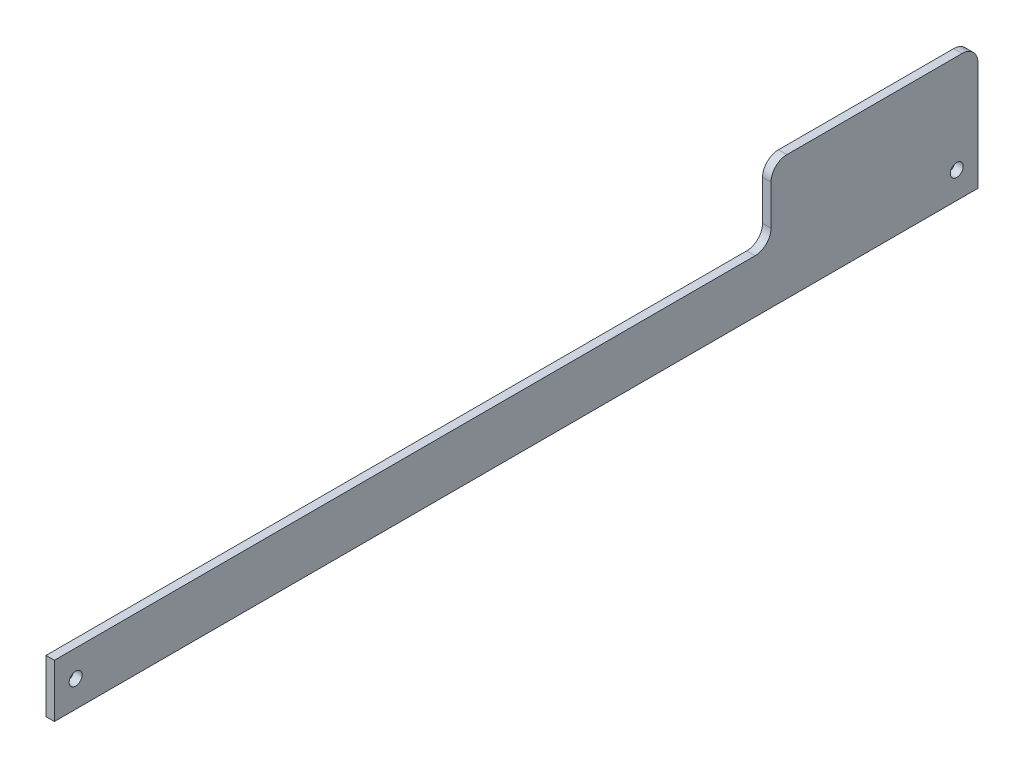
ISO-10303-21;
HEADER;
FILE_DESCRIPTION(('STEP AP214'),'2;1');
FILE_NAME('part.step','',(''),(''),'','','');
FILE_SCHEMA(('AUTOMOTIVE_DESIGN { 1 0 10303 214 1 1 1 1 }'));
ENDSEC;
DATA;
#1=APPLICATION_CONTEXT('core data for automotive mechanical design processes');
#2=APPLICATION_PROTOCOL_DEFINITION('international standard','automotive_design',2000,#1);
#3=PRODUCT_CONTEXT('',#1,'mechanical');
#4=PRODUCT('Part','Part','',(#3));
#5=PRODUCT_RELATED_PRODUCT_CATEGORY('part','',(#4));
#6=PRODUCT_DEFINITION_FORMATION('','',#4);
#7=PRODUCT_DEFINITION_CONTEXT('part definition',#1,'design');
#8=PRODUCT_DEFINITION('design','',#6,#7);
#9=PRODUCT_DEFINITION_SHAPE('','',#8);
#10=(LENGTH_UNIT() NAMED_UNIT(*) SI_UNIT(.MILLI.,.METRE.));
#11=(NAMED_UNIT(*) PLANE_ANGLE_UNIT() SI_UNIT($,.RADIAN.));
#12=(NAMED_UNIT(*) SI_UNIT($,.STERADIAN.) SOLID_ANGLE_UNIT());
#13=UNCERTAINTY_MEASURE_WITH_UNIT(LENGTH_MEASURE(1.E-05),#10,'distance_accuracy_value','');
#14=(GEOMETRIC_REPRESENTATION_CONTEXT(3) GLOBAL_UNCERTAINTY_ASSIGNED_CONTEXT((#13)) GLOBAL_UNIT_ASSIGNED_CONTEXT((#10,
#11,#12)) REPRESENTATION_CONTEXT('',''));
#15=CARTESIAN_POINT('',(0.,0.,0.));
#16=DIRECTION('',(0.,0.,1.));
#17=DIRECTION('',(1.,0.,0.));
#18=AXIS2_PLACEMENT_3D('',#15,#16,#17);
#19=CARTESIAN_POINT('',(1.5875,10.,0.));
#20=DIRECTION('',(0.,0.,-1.));
#21=DIRECTION('',(0.,1.,0.));
#22=AXIS2_PLACEMENT_3D('',#19,#20,#21);
#23=PLANE('',#22);
#24=DIRECTION('',(0.,-1.,0.));
#25=VECTOR('',#24,1.);
#26=CARTESIAN_POINT('',(0.,10.,0.));
#27=LINE('',#26,#25);
#28=CARTESIAN_POINT('',(0.,10.,0.));
#29=VERTEX_POINT('',#28);
#30=CARTESIAN_POINT('',(0.,0.,0.));
#31=VERTEX_POINT('',#30);
#32=EDGE_CURVE('E128',#29,#31,#27,.T.);
#33=ORIENTED_EDGE('',*,*,#32,.T.);
#34=DIRECTION('',(-1.,0.,0.));
#35=VECTOR('',#34,1.);
#36=CARTESIAN_POINT('',(1.5875,0.,0.));
#37=LINE('',#36,#35);
#38=CARTESIAN_POINT('',(1.5875,0.,0.));
#39=VERTEX_POINT('',#38);
#40=EDGE_CURVE('E110',#39,#31,#37,.T.);
#41=ORIENTED_EDGE('',*,*,#40,.F.);
#42=DIRECTION('',(0.,-1.,0.));
#43=VECTOR('',#42,1.);
#44=CARTESIAN_POINT('',(1.5875,10.,0.));
#45=LINE('',#44,#43);
#46=CARTESIAN_POINT('',(1.5875,10.,0.));
#47=VERTEX_POINT('',#46);
#48=EDGE_CURVE('E116',#47,#39,#45,.T.);
#49=ORIENTED_EDGE('',*,*,#48,.F.);
#50=DIRECTION('',(-1.,0.,0.));
#51=VECTOR('',#50,1.);
#52=CARTESIAN_POINT('',(1.5875,10.,0.));
#53=LINE('',#52,#51);
#54=EDGE_CURVE('E134',#47,#29,#53,.T.);
#55=ORIENTED_EDGE('',*,*,#54,.T.);
#56=EDGE_LOOP('',(#33,#41,#49,#55));
#57=FACE_BOUND('',#56,.T.);
#58=ADVANCED_FACE('F32',(#57),#23,.F.);
#59=CARTESIAN_POINT('',(1.5875,0.,0.));
#60=DIRECTION('',(0.,1.,0.));
#61=DIRECTION('',(0.,0.,1.));
#62=AXIS2_PLACEMENT_3D('',#59,#60,#61);
#63=PLANE('',#62);
#64=DIRECTION('',(0.,0.,-1.));
#65=VECTOR('',#64,1.);
#66=CARTESIAN_POINT('',(0.,0.,0.));
#67=LINE('',#66,#65);
#68=CARTESIAN_POINT('',(0.,0.,-174.));
#69=VERTEX_POINT('',#68);
#70=EDGE_CURVE('E181',#31,#69,#67,.T.);
#71=ORIENTED_EDGE('',*,*,#70,.T.);
#72=DIRECTION('',(-1.,0.,0.));
#73=VECTOR('',#72,1.);
#74=CARTESIAN_POINT('',(1.5875,0.,-174.));
#75=LINE('',#74,#73);
#76=CARTESIAN_POINT('',(1.5875,0.,-174.));
#77=VERTEX_POINT('',#76);
#78=EDGE_CURVE('E113',#77,#69,#75,.T.);
#79=ORIENTED_EDGE('',*,*,#78,.F.);
#80=DIRECTION('',(0.,0.,-1.));
#81=VECTOR('',#80,1.);
#82=CARTESIAN_POINT('',(1.5875,0.,0.));
#83=LINE('',#82,#81);
#84=EDGE_CURVE('E106',#39,#77,#83,.T.);
#85=ORIENTED_EDGE('',*,*,#84,.F.);
#86=ORIENTED_EDGE('',*,*,#40,.T.);
#87=EDGE_LOOP('',(#71,#79,#85,#86));
#88=FACE_BOUND('',#87,.T.);
#89=ADVANCED_FACE('F108',(#88),#63,.F.);
#90=CARTESIAN_POINT('',(1.5875,0.,-174.));
#91=DIRECTION('',(0.,0.,1.));
#92=DIRECTION('',(1.,0.,0.));
#93=AXIS2_PLACEMENT_3D('',#90,#91,#92);
#94=PLANE('',#93);
#95=DIRECTION('',(0.,1.,0.));
#96=VECTOR('',#95,1.);
#97=CARTESIAN_POINT('',(0.,0.,-174.));
#98=LINE('',#97,#96);
#99=CARTESIAN_POINT('',(0.,20.5,-174.));
#100=VERTEX_POINT('',#99);
#101=EDGE_CURVE('E184',#69,#100,#98,.T.);
#102=ORIENTED_EDGE('',*,*,#101,.T.);
#103=DIRECTION('',(-1.,0.,0.));
#104=VECTOR('',#103,1.);
#105=CARTESIAN_POINT('',(1.5875,20.5,-174.));
#106=LINE('',#105,#104);
#107=CARTESIAN_POINT('',(1.5875,20.5,-174.));
#108=VERTEX_POINT('',#107);
#109=EDGE_CURVE('E47',#100,#108,#106,.F.);
#110=ORIENTED_EDGE('',*,*,#109,.T.);
#111=DIRECTION('',(0.,1.,0.));
#112=VECTOR('',#111,1.);
#113=CARTESIAN_POINT('',(1.5875,0.,-174.));
#114=LINE('',#113,#112);
#115=EDGE_CURVE('E115',#77,#108,#114,.T.);
#116=ORIENTED_EDGE('',*,*,#115,.F.);
#117=ORIENTED_EDGE('',*,*,#78,.T.);
#118=EDGE_LOOP('',(#102,#110,#116,#117));
#119=FACE_BOUND('',#118,.T.);
#120=ADVANCED_FACE('F188',(#119),#94,.F.);
#121=CARTESIAN_POINT('',(1.5875,23.5,-174.));
#122=DIRECTION('',(0.,-1.,0.));
#123=DIRECTION('',(0.,0.,-1.));
#124=AXIS2_PLACEMENT_3D('',#121,#122,#123);
#125=PLANE('',#124);
#126=DIRECTION('',(0.,0.,1.));
#127=VECTOR('',#126,1.);
#128=CARTESIAN_POINT('',(0.,23.5,-174.));
#129=LINE('',#128,#127);
#130=CARTESIAN_POINT('',(0.,23.5,-171.));
#131=VERTEX_POINT('',#130);
#132=CARTESIAN_POINT('',(0.,23.5,-138.));
#133=VERTEX_POINT('',#132);
#134=EDGE_CURVE('E168',#131,#133,#129,.T.);
#135=ORIENTED_EDGE('',*,*,#134,.T.);
#136=DIRECTION('',(-1.,0.,0.));
#137=VECTOR('',#136,1.);
#138=CARTESIAN_POINT('',(1.5875,23.5,-138.));
#139=LINE('',#138,#137);
#140=CARTESIAN_POINT('',(1.5875,23.5,-138.));
#141=VERTEX_POINT('',#140);
#142=EDGE_CURVE('E55',#133,#141,#139,.F.);
#143=ORIENTED_EDGE('',*,*,#142,.T.);
#144=DIRECTION('',(0.,0.,1.));
#145=VECTOR('',#144,1.);
#146=CARTESIAN_POINT('',(1.5875,23.5,-174.));
#147=LINE('',#146,#145);
#148=CARTESIAN_POINT('',(1.5875,23.5,-171.));
#149=VERTEX_POINT('',#148);
#150=EDGE_CURVE('E176',#149,#141,#147,.T.);
#151=ORIENTED_EDGE('',*,*,#150,.F.);
#152=DIRECTION('',(-1.,0.,0.));
#153=VECTOR('',#152,1.);
#154=CARTESIAN_POINT('',(1.5875,23.5,-171.));
#155=LINE('',#154,#153);
#156=EDGE_CURVE('E146',#149,#131,#155,.T.);
#157=ORIENTED_EDGE('',*,*,#156,.T.);
#158=EDGE_LOOP('',(#135,#143,#151,#157));
#159=FACE_BOUND('',#158,.T.);
#160=ADVANCED_FACE('F242',(#159),#125,.F.);
#161=CARTESIAN_POINT('',(1.5875,23.5,-135.));
#162=DIRECTION('',(0.,0.,-1.));
#163=DIRECTION('',(-1.,0.,0.));
#164=AXIS2_PLACEMENT_3D('',#161,#162,#163);
#165=PLANE('',#164);
#166=DIRECTION('',(0.,-1.,0.));
#167=VECTOR('',#166,1.);
#168=CARTESIAN_POINT('',(0.,23.5,-135.));
#169=LINE('',#168,#167);
#170=CARTESIAN_POINT('',(0.,20.5,-135.));
#171=VERTEX_POINT('',#170);
#172=CARTESIAN_POINT('',(0.,13.,-135.));
#173=VERTEX_POINT('',#172);
#174=EDGE_CURVE('E159',#171,#173,#169,.T.);
#175=ORIENTED_EDGE('',*,*,#174,.T.);
#176=DIRECTION('',(-1.,0.,0.));
#177=VECTOR('',#176,1.);
#178=CARTESIAN_POINT('',(1.5875,13.,-135.));
#179=LINE('',#178,#177);
#180=CARTESIAN_POINT('',(1.5875,13.,-135.));
#181=VERTEX_POINT('',#180);
#182=EDGE_CURVE('E140',#173,#181,#179,.F.);
#183=ORIENTED_EDGE('',*,*,#182,.T.);
#184=DIRECTION('',(0.,-1.,0.));
#185=VECTOR('',#184,1.);
#186=CARTESIAN_POINT('',(1.5875,23.5,-135.));
#187=LINE('',#186,#185);
#188=CARTESIAN_POINT('',(1.5875,20.5,-135.));
#189=VERTEX_POINT('',#188);
#190=EDGE_CURVE('E172',#189,#181,#187,.T.);
#191=ORIENTED_EDGE('',*,*,#190,.F.);
#192=DIRECTION('',(-1.,0.,0.));
#193=VECTOR('',#192,1.);
#194=CARTESIAN_POINT('',(1.5875,20.5,-135.));
#195=LINE('',#194,#193);
#196=EDGE_CURVE('E132',#189,#171,#195,.T.);
#197=ORIENTED_EDGE('',*,*,#196,.T.);
#198=EDGE_LOOP('',(#175,#183,#191,#197));
#199=FACE_BOUND('',#198,.T.);
#200=ADVANCED_FACE('F164',(#199),#165,.F.);
#201=CARTESIAN_POINT('',(1.5875,10.,-135.));
#202=DIRECTION('',(0.,-1.,0.));
#203=DIRECTION('',(0.,0.,-1.));
#204=AXIS2_PLACEMENT_3D('',#201,#202,#203);
#205=PLANE('',#204);
#206=DIRECTION('',(0.,0.,1.));
#207=VECTOR('',#206,1.);
#208=CARTESIAN_POINT('',(1.5875,10.,-135.));
#209=LINE('',#208,#207);
#210=CARTESIAN_POINT('',(1.5875,10.,-132.));
#211=VERTEX_POINT('',#210);
#212=EDGE_CURVE('E121',#211,#47,#209,.T.);
#213=ORIENTED_EDGE('',*,*,#212,.F.);
#214=DIRECTION('',(-1.,0.,0.));
#215=VECTOR('',#214,1.);
#216=CARTESIAN_POINT('',(0.,10.,-132.));
#217=LINE('',#216,#215);
#218=CARTESIAN_POINT('',(0.,10.,-132.));
#219=VERTEX_POINT('',#218);
#220=EDGE_CURVE('E129',#211,#219,#217,.T.);
#221=ORIENTED_EDGE('',*,*,#220,.T.);
#222=DIRECTION('',(0.,0.,1.));
#223=VECTOR('',#222,1.);
#224=CARTESIAN_POINT('',(0.,10.,-135.));
#225=LINE('',#224,#223);
#226=EDGE_CURVE('E125',#219,#29,#225,.T.);
#227=ORIENTED_EDGE('',*,*,#226,.T.);
#228=ORIENTED_EDGE('',*,*,#54,.F.);
#229=EDGE_LOOP('',(#213,#221,#227,#228));
#230=FACE_BOUND('',#229,.T.);
#231=ADVANCED_FACE('F174',(#230),#205,.F.);
#232=CARTESIAN_POINT('',(1.5875,0.,0.));
#233=DIRECTION('',(1.,0.,0.));
#234=DIRECTION('',(0.,0.,-1.));
#235=AXIS2_PLACEMENT_3D('',#232,#233,#234);
#236=PLANE('',#235);
#237=CARTESIAN_POINT('',(1.5875,5.,-4.));
#238=DIRECTION('',(1.,0.,0.));
#239=DIRECTION('',(0.,0.,-1.));
#240=AXIS2_PLACEMENT_3D('',#237,#238,#239);
#241=CIRCLE('',#240,1.21919999999999);
#242=CARTESIAN_POINT('',(1.5875,5.,-5.21919999999999));
#243=VERTEX_POINT('',#242);
#244=EDGE_CURVE('E200',#243,#243,#241,.T.);
#245=ORIENTED_EDGE('',*,*,#244,.F.);
#246=EDGE_LOOP('',(#245));
#247=FACE_BOUND('',#246,.T.);
#248=CARTESIAN_POINT('',(1.5875,5.,-170.));
#249=DIRECTION('',(1.,0.,0.));
#250=DIRECTION('',(0.,0.,-1.));
#251=AXIS2_PLACEMENT_3D('',#248,#249,#250);
#252=CIRCLE('',#251,1.21919999999999);
#253=CARTESIAN_POINT('',(1.5875,5.,-171.2192));
#254=VERTEX_POINT('',#253);
#255=EDGE_CURVE('E194',#254,#254,#252,.T.);
#256=ORIENTED_EDGE('',*,*,#255,.F.);
#257=EDGE_LOOP('',(#256));
#258=FACE_BOUND('',#257,.T.);
#259=ORIENTED_EDGE('',*,*,#150,.T.);
#260=CARTESIAN_POINT('',(1.5875,20.5,-138.));
#261=DIRECTION('',(1.,0.,0.));
#262=DIRECTION('',(0.,0.,-1.));
#263=AXIS2_PLACEMENT_3D('',#260,#261,#262);
#264=CIRCLE('',#263,3.);
#265=EDGE_CURVE('E152',#141,#189,#264,.T.);
#266=ORIENTED_EDGE('',*,*,#265,.T.);
#267=ORIENTED_EDGE('',*,*,#190,.T.);
#268=CARTESIAN_POINT('',(1.5875,13.,-132.));
#269=DIRECTION('',(1.,0.,0.));
#270=DIRECTION('',(0.,0.,-1.));
#271=AXIS2_PLACEMENT_3D('',#268,#269,#270);
#272=CIRCLE('',#271,3.);
#273=EDGE_CURVE('E11',#181,#211,#272,.F.);
#274=ORIENTED_EDGE('',*,*,#273,.T.);
#275=ORIENTED_EDGE('',*,*,#212,.T.);
#276=ORIENTED_EDGE('',*,*,#48,.T.);
#277=ORIENTED_EDGE('',*,*,#84,.T.);
#278=ORIENTED_EDGE('',*,*,#115,.T.);
#279=CARTESIAN_POINT('',(1.5875,20.5,-171.));
#280=DIRECTION('',(1.,0.,0.));
#281=DIRECTION('',(0.,0.,-1.));
#282=AXIS2_PLACEMENT_3D('',#279,#280,#281);
#283=CIRCLE('',#282,3.);
#284=EDGE_CURVE('E150',#108,#149,#283,.T.);
#285=ORIENTED_EDGE('',*,*,#284,.T.);
#286=EDGE_LOOP('',(#259,#266,#267,#274,#275,#276,#277,#278,#285));
#287=FACE_BOUND('',#286,.T.);
#288=ADVANCED_FACE('F119',(#247,#258,#287),#236,.T.);
#289=CARTESIAN_POINT('',(0.,0.,0.));
#290=DIRECTION('',(1.,0.,0.));
#291=DIRECTION('',(0.,0.,-1.));
#292=AXIS2_PLACEMENT_3D('',#289,#290,#291);
#293=PLANE('',#292);
#294=CARTESIAN_POINT('',(0.,5.,-4.));
#295=DIRECTION('',(1.,0.,0.));
#296=DIRECTION('',(0.,0.,-1.));
#297=AXIS2_PLACEMENT_3D('',#294,#295,#296);
#298=CIRCLE('',#297,1.2192);
#299=CARTESIAN_POINT('',(0.,5.,-5.2192));
#300=VERTEX_POINT('',#299);
#301=EDGE_CURVE('E197',#300,#300,#298,.T.);
#302=ORIENTED_EDGE('',*,*,#301,.T.);
#303=EDGE_LOOP('',(#302));
#304=FACE_BOUND('',#303,.T.);
#305=CARTESIAN_POINT('',(0.,5.,-170.));
#306=DIRECTION('',(1.,0.,0.));
#307=DIRECTION('',(0.,0.,-1.));
#308=AXIS2_PLACEMENT_3D('',#305,#306,#307);
#309=CIRCLE('',#308,1.2192);
#310=CARTESIAN_POINT('',(0.,5.,-171.2192));
#311=VERTEX_POINT('',#310);
#312=EDGE_CURVE('E182',#311,#311,#309,.T.);
#313=ORIENTED_EDGE('',*,*,#312,.T.);
#314=EDGE_LOOP('',(#313));
#315=FACE_BOUND('',#314,.T.);
#316=ORIENTED_EDGE('',*,*,#174,.F.);
#317=CARTESIAN_POINT('',(0.,20.5,-138.));
#318=DIRECTION('',(1.,0.,0.));
#319=DIRECTION('',(0.,0.,-1.));
#320=AXIS2_PLACEMENT_3D('',#317,#318,#319);
#321=CIRCLE('',#320,3.);
#322=EDGE_CURVE('E144',#171,#133,#321,.F.);
#323=ORIENTED_EDGE('',*,*,#322,.T.);
#324=ORIENTED_EDGE('',*,*,#134,.F.);
#325=CARTESIAN_POINT('',(0.,20.5,-171.));
#326=DIRECTION('',(1.,0.,0.));
#327=DIRECTION('',(0.,0.,-1.));
#328=AXIS2_PLACEMENT_3D('',#325,#326,#327);
#329=CIRCLE('',#328,3.);
#330=EDGE_CURVE('E142',#131,#100,#329,.F.);
#331=ORIENTED_EDGE('',*,*,#330,.T.);
#332=ORIENTED_EDGE('',*,*,#101,.F.);
#333=ORIENTED_EDGE('',*,*,#70,.F.);
#334=ORIENTED_EDGE('',*,*,#32,.F.);
#335=ORIENTED_EDGE('',*,*,#226,.F.);
#336=CARTESIAN_POINT('',(0.,13.,-132.));
#337=DIRECTION('',(1.,0.,0.));
#338=DIRECTION('',(0.,0.,-1.));
#339=AXIS2_PLACEMENT_3D('',#336,#337,#338);
#340=CIRCLE('',#339,3.);
#341=EDGE_CURVE('E40',#219,#173,#340,.T.);
#342=ORIENTED_EDGE('',*,*,#341,.T.);
#343=EDGE_LOOP('',(#316,#323,#324,#331,#332,#333,#334,#335,#342));
#344=FACE_BOUND('',#343,.T.);
#345=ADVANCED_FACE('F158',(#304,#315,#344),#293,.F.);
#346=CARTESIAN_POINT('',(1.5875,5.,-170.));
#347=DIRECTION('',(1.,0.,0.));
#348=DIRECTION('',(0.,0.,-1.));
#349=AXIS2_PLACEMENT_3D('',#346,#347,#348);
#350=CYLINDRICAL_SURFACE('',#349,1.21919999999999);
#351=ORIENTED_EDGE('',*,*,#312,.F.);
#352=EDGE_LOOP('',(#351));
#353=FACE_BOUND('',#352,.T.);
#354=ORIENTED_EDGE('',*,*,#255,.T.);
#355=EDGE_LOOP('',(#354));
#356=FACE_BOUND('',#355,.T.);
#357=ADVANCED_FACE('F211',(#353,#356),#350,.F.);
#358=CARTESIAN_POINT('',(1.5875,5.,-4.));
#359=DIRECTION('',(1.,0.,0.));
#360=DIRECTION('',(0.,0.,-1.));
#361=AXIS2_PLACEMENT_3D('',#358,#359,#360);
#362=CYLINDRICAL_SURFACE('',#361,1.21919999999999);
#363=ORIENTED_EDGE('',*,*,#301,.F.);
#364=EDGE_LOOP('',(#363));
#365=FACE_BOUND('',#364,.T.);
#366=ORIENTED_EDGE('',*,*,#244,.T.);
#367=EDGE_LOOP('',(#366));
#368=FACE_BOUND('',#367,.T.);
#369=ADVANCED_FACE('F204',(#365,#368),#362,.F.);
#370=CARTESIAN_POINT('',(1.5875,13.,-132.));
#371=DIRECTION('',(1.,0.,0.));
#372=DIRECTION('',(0.,0.,-1.));
#373=AXIS2_PLACEMENT_3D('',#370,#371,#372);
#374=CYLINDRICAL_SURFACE('',#373,3.);
#375=ORIENTED_EDGE('',*,*,#273,.F.);
#376=ORIENTED_EDGE('',*,*,#182,.F.);
#377=ORIENTED_EDGE('',*,*,#341,.F.);
#378=ORIENTED_EDGE('',*,*,#220,.F.);
#379=EDGE_LOOP('',(#375,#376,#377,#378));
#380=FACE_BOUND('',#379,.T.);
#381=ADVANCED_FACE('F171',(#380),#374,.F.);
#382=CARTESIAN_POINT('',(1.5875,20.5,-138.));
#383=DIRECTION('',(-1.,0.,0.));
#384=DIRECTION('',(0.,0.,1.));
#385=AXIS2_PLACEMENT_3D('',#382,#383,#384);
#386=CYLINDRICAL_SURFACE('',#385,3.);
#387=ORIENTED_EDGE('',*,*,#265,.F.);
#388=ORIENTED_EDGE('',*,*,#142,.F.);
#389=ORIENTED_EDGE('',*,*,#322,.F.);
#390=ORIENTED_EDGE('',*,*,#196,.F.);
#391=EDGE_LOOP('',(#387,#388,#389,#390));
#392=FACE_BOUND('',#391,.T.);
#393=ADVANCED_FACE('F233',(#392),#386,.T.);
#394=CARTESIAN_POINT('',(1.5875,20.5,-171.));
#395=DIRECTION('',(-1.,0.,0.));
#396=DIRECTION('',(0.,0.,1.));
#397=AXIS2_PLACEMENT_3D('',#394,#395,#396);
#398=CYLINDRICAL_SURFACE('',#397,3.);
#399=ORIENTED_EDGE('',*,*,#284,.F.);
#400=ORIENTED_EDGE('',*,*,#109,.F.);
#401=ORIENTED_EDGE('',*,*,#330,.F.);
#402=ORIENTED_EDGE('',*,*,#156,.F.);
#403=EDGE_LOOP('',(#399,#400,#401,#402));
#404=FACE_BOUND('',#403,.T.);
#405=ADVANCED_FACE('F34',(#404),#398,.T.);
#406=CLOSED_SHELL('',(#58,#89,#120,#160,#200,#231,#288,#345,#357,#369,#381,#393,#405));
#407=MANIFOLD_SOLID_BREP('B2',#406);
#408=ADVANCED_BREP_SHAPE_REPRESENTATION('',(#18,#407),#14);
#409=SHAPE_DEFINITION_REPRESENTATION(#9,#408);
ENDSEC;
END-ISO-10303-21;
